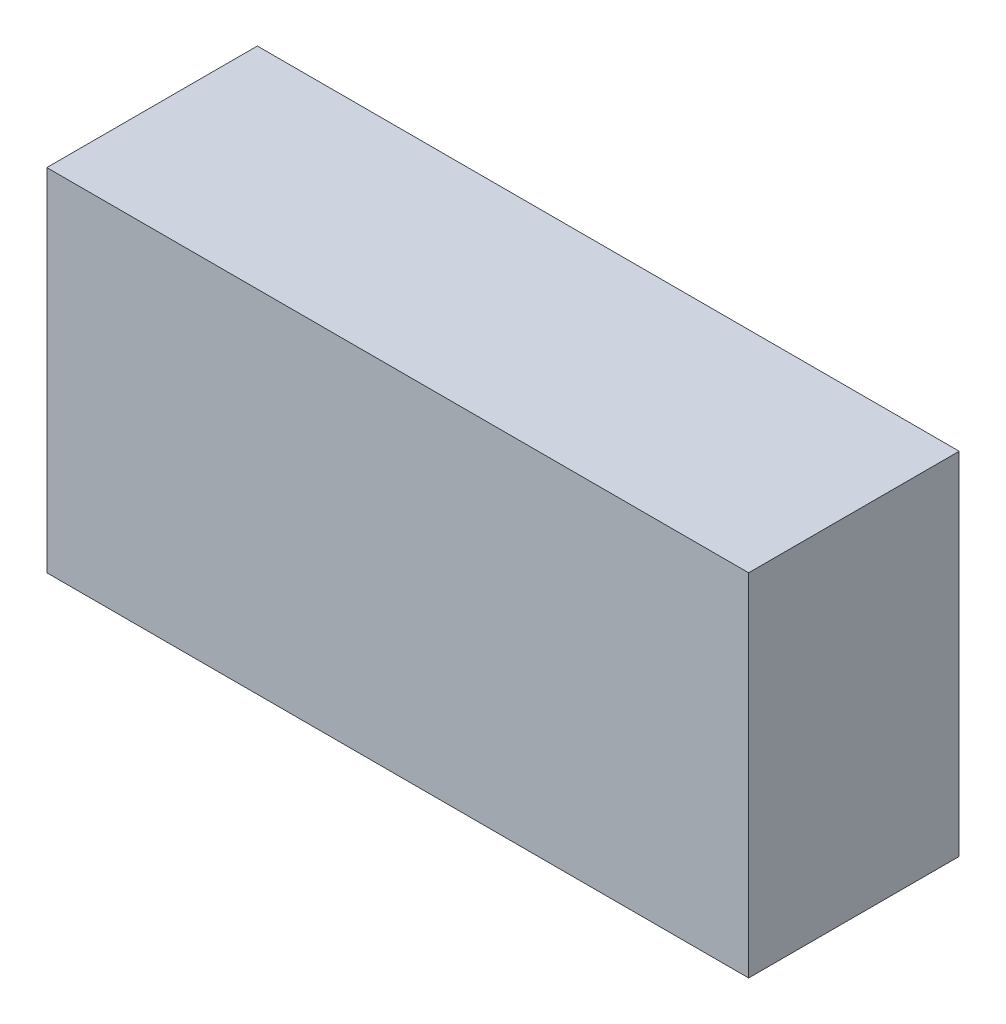
ISO-10303-21;
HEADER;
FILE_DESCRIPTION(('STEP AP214'),'2;1');
FILE_NAME('part.step','',(''),(''),'','','');
FILE_SCHEMA(('AUTOMOTIVE_DESIGN { 1 0 10303 214 1 1 1 1 }'));
ENDSEC;
DATA;
#1=APPLICATION_CONTEXT('core data for automotive mechanical design processes');
#2=APPLICATION_PROTOCOL_DEFINITION('international standard','automotive_design',2000,#1);
#3=PRODUCT_CONTEXT('',#1,'mechanical');
#4=PRODUCT('Part','Part','',(#3));
#5=PRODUCT_RELATED_PRODUCT_CATEGORY('part','',(#4));
#6=PRODUCT_DEFINITION_FORMATION('','',#4);
#7=PRODUCT_DEFINITION_CONTEXT('part definition',#1,'design');
#8=PRODUCT_DEFINITION('design','',#6,#7);
#9=PRODUCT_DEFINITION_SHAPE('','',#8);
#10=(LENGTH_UNIT() NAMED_UNIT(*) SI_UNIT(.MILLI.,.METRE.));
#11=(NAMED_UNIT(*) PLANE_ANGLE_UNIT() SI_UNIT($,.RADIAN.));
#12=(NAMED_UNIT(*) SI_UNIT($,.STERADIAN.) SOLID_ANGLE_UNIT());
#13=UNCERTAINTY_MEASURE_WITH_UNIT(LENGTH_MEASURE(1.E-05),#10,'distance_accuracy_value','');
#14=(GEOMETRIC_REPRESENTATION_CONTEXT(3) GLOBAL_UNCERTAINTY_ASSIGNED_CONTEXT((#13)) GLOBAL_UNIT_ASSIGNED_CONTEXT((#10,
#11,#12)) REPRESENTATION_CONTEXT('',''));
#15=CARTESIAN_POINT('',(0.,0.,0.));
#16=DIRECTION('',(0.,0.,1.));
#17=DIRECTION('',(1.,0.,0.));
#18=AXIS2_PLACEMENT_3D('',#15,#16,#17);
#19=CARTESIAN_POINT('',(-5.,-2.5,3.));
#20=DIRECTION('',(1.,0.,0.));
#21=DIRECTION('',(0.,0.,-1.));
#22=AXIS2_PLACEMENT_3D('',#19,#20,#21);
#23=PLANE('',#22);
#24=DIRECTION('',(0.,-1.,0.));
#25=VECTOR('',#24,1.);
#26=CARTESIAN_POINT('',(-5.,-2.5,0.));
#27=LINE('',#26,#25);
#28=CARTESIAN_POINT('',(-5.,2.5,0.));
#29=VERTEX_POINT('',#28);
#30=CARTESIAN_POINT('',(-5.,-2.5,0.));
#31=VERTEX_POINT('',#30);
#32=EDGE_CURVE('E98',#29,#31,#27,.T.);
#33=ORIENTED_EDGE('',*,*,#32,.T.);
#34=DIRECTION('',(0.,0.,-1.));
#35=VECTOR('',#34,1.);
#36=CARTESIAN_POINT('',(-5.,-2.5,3.));
#37=LINE('',#36,#35);
#38=CARTESIAN_POINT('',(-5.,-2.5,3.));
#39=VERTEX_POINT('',#38);
#40=EDGE_CURVE('E11',#39,#31,#37,.T.);
#41=ORIENTED_EDGE('',*,*,#40,.F.);
#42=DIRECTION('',(0.,-1.,0.));
#43=VECTOR('',#42,1.);
#44=CARTESIAN_POINT('',(-5.,-2.5,3.));
#45=LINE('',#44,#43);
#46=CARTESIAN_POINT('',(-5.,2.5,3.));
#47=VERTEX_POINT('',#46);
#48=EDGE_CURVE('E86',#47,#39,#45,.T.);
#49=ORIENTED_EDGE('',*,*,#48,.F.);
#50=DIRECTION('',(0.,0.,-1.));
#51=VECTOR('',#50,1.);
#52=CARTESIAN_POINT('',(-5.,2.5,3.));
#53=LINE('',#52,#51);
#54=EDGE_CURVE('E94',#47,#29,#53,.T.);
#55=ORIENTED_EDGE('',*,*,#54,.T.);
#56=EDGE_LOOP('',(#33,#41,#49,#55));
#57=FACE_BOUND('',#56,.T.);
#58=ADVANCED_FACE('F35',(#57),#23,.F.);
#59=CARTESIAN_POINT('',(5.,-2.5,3.));
#60=DIRECTION('',(0.,1.,0.));
#61=DIRECTION('',(-1.,0.,0.));
#62=AXIS2_PLACEMENT_3D('',#59,#60,#61);
#63=PLANE('',#62);
#64=DIRECTION('',(1.,0.,0.));
#65=VECTOR('',#64,1.);
#66=CARTESIAN_POINT('',(5.,-2.5,0.));
#67=LINE('',#66,#65);
#68=CARTESIAN_POINT('',(5.,-2.5,0.));
#69=VERTEX_POINT('',#68);
#70=EDGE_CURVE('E90',#31,#69,#67,.T.);
#71=ORIENTED_EDGE('',*,*,#70,.T.);
#72=DIRECTION('',(0.,0.,-1.));
#73=VECTOR('',#72,1.);
#74=CARTESIAN_POINT('',(5.,-2.5,3.));
#75=LINE('',#74,#73);
#76=CARTESIAN_POINT('',(5.,-2.5,3.));
#77=VERTEX_POINT('',#76);
#78=EDGE_CURVE('E43',#77,#69,#75,.T.);
#79=ORIENTED_EDGE('',*,*,#78,.F.);
#80=DIRECTION('',(1.,0.,0.));
#81=VECTOR('',#80,1.);
#82=CARTESIAN_POINT('',(5.,-2.5,3.));
#83=LINE('',#82,#81);
#84=EDGE_CURVE('E81',#39,#77,#83,.T.);
#85=ORIENTED_EDGE('',*,*,#84,.F.);
#86=ORIENTED_EDGE('',*,*,#40,.T.);
#87=EDGE_LOOP('',(#71,#79,#85,#86));
#88=FACE_BOUND('',#87,.T.);
#89=ADVANCED_FACE('F89',(#88),#63,.F.);
#90=CARTESIAN_POINT('',(5.,-2.5,3.));
#91=DIRECTION('',(-1.,0.,0.));
#92=DIRECTION('',(0.,0.,1.));
#93=AXIS2_PLACEMENT_3D('',#90,#91,#92);
#94=PLANE('',#93);
#95=DIRECTION('',(0.,1.,0.));
#96=VECTOR('',#95,1.);
#97=CARTESIAN_POINT('',(5.,-2.5,0.));
#98=LINE('',#97,#96);
#99=CARTESIAN_POINT('',(5.,2.5,0.));
#100=VERTEX_POINT('',#99);
#101=EDGE_CURVE('E68',#69,#100,#98,.T.);
#102=ORIENTED_EDGE('',*,*,#101,.T.);
#103=DIRECTION('',(0.,0.,-1.));
#104=VECTOR('',#103,1.);
#105=CARTESIAN_POINT('',(5.,2.5,3.));
#106=LINE('',#105,#104);
#107=CARTESIAN_POINT('',(5.,2.5,3.));
#108=VERTEX_POINT('',#107);
#109=EDGE_CURVE('E91',#108,#100,#106,.T.);
#110=ORIENTED_EDGE('',*,*,#109,.F.);
#111=DIRECTION('',(0.,1.,0.));
#112=VECTOR('',#111,1.);
#113=CARTESIAN_POINT('',(5.,-2.5,3.));
#114=LINE('',#113,#112);
#115=EDGE_CURVE('E84',#77,#108,#114,.T.);
#116=ORIENTED_EDGE('',*,*,#115,.F.);
#117=ORIENTED_EDGE('',*,*,#78,.T.);
#118=EDGE_LOOP('',(#102,#110,#116,#117));
#119=FACE_BOUND('',#118,.T.);
#120=ADVANCED_FACE('F92',(#119),#94,.F.);
#121=CARTESIAN_POINT('',(5.,2.5,3.));
#122=DIRECTION('',(0.,-1.,0.));
#123=DIRECTION('',(1.,0.,0.));
#124=AXIS2_PLACEMENT_3D('',#121,#122,#123);
#125=PLANE('',#124);
#126=DIRECTION('',(-1.,0.,0.));
#127=VECTOR('',#126,1.);
#128=CARTESIAN_POINT('',(5.,2.5,0.));
#129=LINE('',#128,#127);
#130=EDGE_CURVE('E74',#100,#29,#129,.T.);
#131=ORIENTED_EDGE('',*,*,#130,.T.);
#132=ORIENTED_EDGE('',*,*,#54,.F.);
#133=DIRECTION('',(-1.,0.,0.));
#134=VECTOR('',#133,1.);
#135=CARTESIAN_POINT('',(5.,2.5,3.));
#136=LINE('',#135,#134);
#137=EDGE_CURVE('E51',#108,#47,#136,.T.);
#138=ORIENTED_EDGE('',*,*,#137,.F.);
#139=ORIENTED_EDGE('',*,*,#109,.T.);
#140=EDGE_LOOP('',(#131,#132,#138,#139));
#141=FACE_BOUND('',#140,.T.);
#142=ADVANCED_FACE('F105',(#141),#125,.F.);
#143=CARTESIAN_POINT('',(0.,0.,3.));
#144=DIRECTION('',(0.,0.,1.));
#145=DIRECTION('',(1.,0.,0.));
#146=AXIS2_PLACEMENT_3D('',#143,#144,#145);
#147=PLANE('',#146);
#148=ORIENTED_EDGE('',*,*,#48,.T.);
#149=ORIENTED_EDGE('',*,*,#84,.T.);
#150=ORIENTED_EDGE('',*,*,#115,.T.);
#151=ORIENTED_EDGE('',*,*,#137,.T.);
#152=EDGE_LOOP('',(#148,#149,#150,#151));
#153=FACE_BOUND('',#152,.T.);
#154=ADVANCED_FACE('F82',(#153),#147,.T.);
#155=CARTESIAN_POINT('',(0.,0.,0.));
#156=DIRECTION('',(0.,0.,1.));
#157=DIRECTION('',(1.,0.,0.));
#158=AXIS2_PLACEMENT_3D('',#155,#156,#157);
#159=PLANE('',#158);
#160=ORIENTED_EDGE('',*,*,#32,.F.);
#161=ORIENTED_EDGE('',*,*,#130,.F.);
#162=ORIENTED_EDGE('',*,*,#101,.F.);
#163=ORIENTED_EDGE('',*,*,#70,.F.);
#164=EDGE_LOOP('',(#160,#161,#162,#163));
#165=FACE_BOUND('',#164,.T.);
#166=ADVANCED_FACE('F108',(#165),#159,.F.);
#167=CLOSED_SHELL('',(#58,#89,#120,#142,#154,#166));
#168=MANIFOLD_SOLID_BREP('B2',#167);
#169=ADVANCED_BREP_SHAPE_REPRESENTATION('',(#18,#168),#14);
#170=SHAPE_DEFINITION_REPRESENTATION(#9,#169);
ENDSEC;
END-ISO-10303-21;
